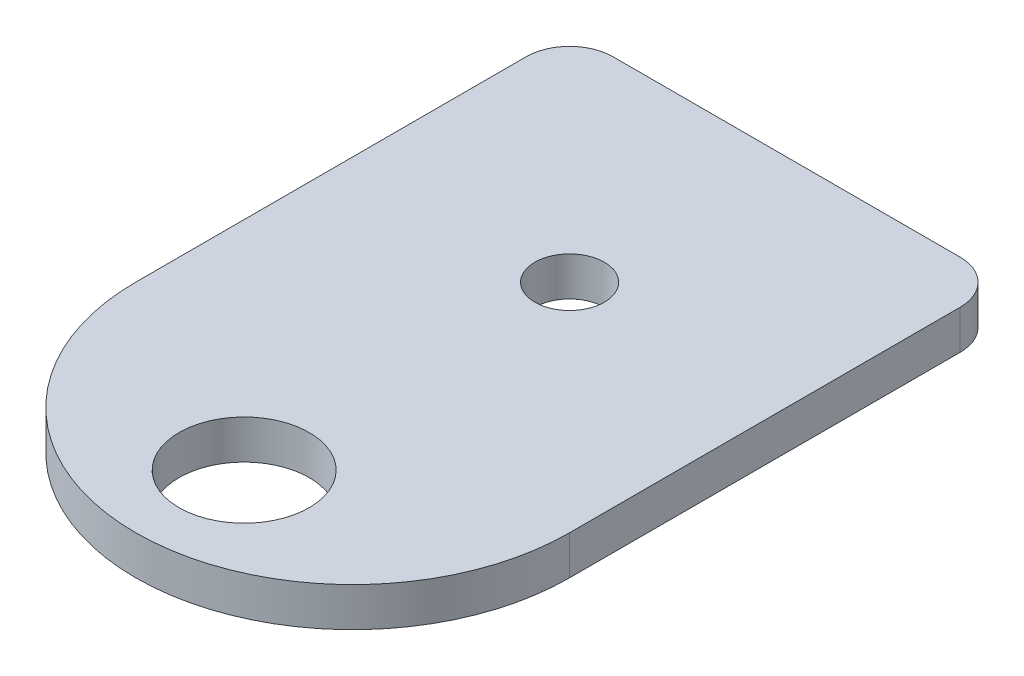
ISO-10303-21;
HEADER;
FILE_DESCRIPTION(('STEP AP214'),'2;1');
FILE_NAME('part.step','',(''),(''),'','','');
FILE_SCHEMA(('AUTOMOTIVE_DESIGN { 1 0 10303 214 1 1 1 1 }'));
ENDSEC;
DATA;
#1=APPLICATION_CONTEXT('core data for automotive mechanical design processes');
#2=APPLICATION_PROTOCOL_DEFINITION('international standard','automotive_design',2000,#1);
#3=PRODUCT_CONTEXT('',#1,'mechanical');
#4=PRODUCT('Part','Part','',(#3));
#5=PRODUCT_RELATED_PRODUCT_CATEGORY('part','',(#4));
#6=PRODUCT_DEFINITION_FORMATION('','',#4);
#7=PRODUCT_DEFINITION_CONTEXT('part definition',#1,'design');
#8=PRODUCT_DEFINITION('design','',#6,#7);
#9=PRODUCT_DEFINITION_SHAPE('','',#8);
#10=(LENGTH_UNIT() NAMED_UNIT(*) SI_UNIT(.MILLI.,.METRE.));
#11=(NAMED_UNIT(*) PLANE_ANGLE_UNIT() SI_UNIT($,.RADIAN.));
#12=(NAMED_UNIT(*) SI_UNIT($,.STERADIAN.) SOLID_ANGLE_UNIT());
#13=UNCERTAINTY_MEASURE_WITH_UNIT(LENGTH_MEASURE(1.E-05),#10,'distance_accuracy_value','');
#14=(GEOMETRIC_REPRESENTATION_CONTEXT(3) GLOBAL_UNCERTAINTY_ASSIGNED_CONTEXT((#13)) GLOBAL_UNIT_ASSIGNED_CONTEXT((#10,
#11,#12)) REPRESENTATION_CONTEXT('',''));
#15=CARTESIAN_POINT('',(0.,0.,0.));
#16=DIRECTION('',(0.,0.,1.));
#17=DIRECTION('',(1.,0.,0.));
#18=AXIS2_PLACEMENT_3D('',#15,#16,#17);
#19=CARTESIAN_POINT('',(22.86,2.286,2.54));
#20=DIRECTION('',(0.,-1.,0.));
#21=DIRECTION('',(0.,0.,-1.));
#22=AXIS2_PLACEMENT_3D('',#19,#20,#21);
#23=CYLINDRICAL_SURFACE('',#22,2.54);
#24=DIRECTION('',(0.,-1.,0.));
#25=VECTOR('',#24,1.);
#26=CARTESIAN_POINT('',(22.86,2.286,0.));
#27=LINE('',#26,#25);
#28=CARTESIAN_POINT('',(22.86,2.286,0.));
#29=VERTEX_POINT('',#28);
#30=CARTESIAN_POINT('',(22.86,0.,0.));
#31=VERTEX_POINT('',#30);
#32=EDGE_CURVE('E121',#29,#31,#27,.T.);
#33=ORIENTED_EDGE('',*,*,#32,.F.);
#34=CARTESIAN_POINT('',(22.86,2.286,2.54));
#35=DIRECTION('',(0.,1.,0.));
#36=DIRECTION('',(0.,0.,1.));
#37=AXIS2_PLACEMENT_3D('',#34,#35,#36);
#38=CIRCLE('',#37,2.54);
#39=CARTESIAN_POINT('',(25.4,2.286,2.54));
#40=VERTEX_POINT('',#39);
#41=EDGE_CURVE('E40',#40,#29,#38,.T.);
#42=ORIENTED_EDGE('',*,*,#41,.F.);
#43=DIRECTION('',(0.,-1.,0.));
#44=VECTOR('',#43,1.);
#45=CARTESIAN_POINT('',(25.4,2.286,2.54));
#46=LINE('',#45,#44);
#47=CARTESIAN_POINT('',(25.4,0.,2.54));
#48=VERTEX_POINT('',#47);
#49=EDGE_CURVE('E89',#48,#40,#46,.F.);
#50=ORIENTED_EDGE('',*,*,#49,.F.);
#51=CARTESIAN_POINT('',(22.86,0.,2.54));
#52=DIRECTION('',(0.,1.,0.));
#53=DIRECTION('',(0.,0.,1.));
#54=AXIS2_PLACEMENT_3D('',#51,#52,#53);
#55=CIRCLE('',#54,2.54);
#56=EDGE_CURVE('E11',#31,#48,#55,.F.);
#57=ORIENTED_EDGE('',*,*,#56,.F.);
#58=EDGE_LOOP('',(#33,#42,#50,#57));
#59=FACE_BOUND('',#58,.T.);
#60=ADVANCED_FACE('F33',(#59),#23,.T.);
#61=CARTESIAN_POINT('',(2.54,2.286,2.54));
#62=DIRECTION('',(0.,1.,0.));
#63=DIRECTION('',(0.,0.,1.));
#64=AXIS2_PLACEMENT_3D('',#61,#62,#63);
#65=CYLINDRICAL_SURFACE('',#64,2.54);
#66=DIRECTION('',(0.,-1.,0.));
#67=VECTOR('',#66,1.);
#68=CARTESIAN_POINT('',(0.,2.286,2.54));
#69=LINE('',#68,#67);
#70=CARTESIAN_POINT('',(0.,2.286,2.54));
#71=VERTEX_POINT('',#70);
#72=CARTESIAN_POINT('',(0.,0.,2.54));
#73=VERTEX_POINT('',#72);
#74=EDGE_CURVE('E106',#71,#73,#69,.T.);
#75=ORIENTED_EDGE('',*,*,#74,.F.);
#76=CARTESIAN_POINT('',(2.54,2.286,2.54));
#77=DIRECTION('',(0.,1.,0.));
#78=DIRECTION('',(0.,0.,1.));
#79=AXIS2_PLACEMENT_3D('',#76,#77,#78);
#80=CIRCLE('',#79,2.54);
#81=CARTESIAN_POINT('',(2.54,2.286,0.));
#82=VERTEX_POINT('',#81);
#83=EDGE_CURVE('E117',#82,#71,#80,.T.);
#84=ORIENTED_EDGE('',*,*,#83,.F.);
#85=DIRECTION('',(0.,-1.,0.));
#86=VECTOR('',#85,1.);
#87=CARTESIAN_POINT('',(2.54,2.286,0.));
#88=LINE('',#87,#86);
#89=CARTESIAN_POINT('',(2.54,0.,0.));
#90=VERTEX_POINT('',#89);
#91=EDGE_CURVE('E110',#90,#82,#88,.F.);
#92=ORIENTED_EDGE('',*,*,#91,.F.);
#93=CARTESIAN_POINT('',(2.54,0.,2.54));
#94=DIRECTION('',(0.,1.,0.));
#95=DIRECTION('',(0.,0.,1.));
#96=AXIS2_PLACEMENT_3D('',#93,#94,#95);
#97=CIRCLE('',#96,2.54);
#98=EDGE_CURVE('E119',#73,#90,#97,.F.);
#99=ORIENTED_EDGE('',*,*,#98,.F.);
#100=EDGE_LOOP('',(#75,#84,#92,#99));
#101=FACE_BOUND('',#100,.T.);
#102=ADVANCED_FACE('F160',(#101),#65,.T.);
#103=CARTESIAN_POINT('',(12.7,2.286,25.4));
#104=DIRECTION('',(0.,-1.,0.));
#105=DIRECTION('',(0.,0.,-1.));
#106=AXIS2_PLACEMENT_3D('',#103,#104,#105);
#107=CYLINDRICAL_SURFACE('',#106,12.7);
#108=CARTESIAN_POINT('',(12.7,0.,25.4));
#109=DIRECTION('',(0.,1.,0.));
#110=DIRECTION('',(0.,0.,1.));
#111=AXIS2_PLACEMENT_3D('',#108,#109,#110);
#112=CIRCLE('',#111,12.7);
#113=CARTESIAN_POINT('',(0.,0.,25.4));
#114=VERTEX_POINT('',#113);
#115=CARTESIAN_POINT('',(25.4,0.,25.4));
#116=VERTEX_POINT('',#115);
#117=EDGE_CURVE('E105',#114,#116,#112,.T.);
#118=ORIENTED_EDGE('',*,*,#117,.T.);
#119=DIRECTION('',(0.,-1.,0.));
#120=VECTOR('',#119,1.);
#121=CARTESIAN_POINT('',(25.4,2.286,25.4));
#122=LINE('',#121,#120);
#123=CARTESIAN_POINT('',(25.4,2.286,25.4));
#124=VERTEX_POINT('',#123);
#125=EDGE_CURVE('E87',#124,#116,#122,.T.);
#126=ORIENTED_EDGE('',*,*,#125,.F.);
#127=CARTESIAN_POINT('',(12.7,2.286,25.4));
#128=DIRECTION('',(0.,1.,0.));
#129=DIRECTION('',(0.,0.,1.));
#130=AXIS2_PLACEMENT_3D('',#127,#128,#129);
#131=CIRCLE('',#130,12.7);
#132=CARTESIAN_POINT('',(0.,2.286,25.4));
#133=VERTEX_POINT('',#132);
#134=EDGE_CURVE('E92',#133,#124,#131,.T.);
#135=ORIENTED_EDGE('',*,*,#134,.F.);
#136=DIRECTION('',(0.,-1.,0.));
#137=VECTOR('',#136,1.);
#138=CARTESIAN_POINT('',(0.,2.286,25.4));
#139=LINE('',#138,#137);
#140=EDGE_CURVE('E107',#133,#114,#139,.T.);
#141=ORIENTED_EDGE('',*,*,#140,.T.);
#142=EDGE_LOOP('',(#118,#126,#135,#141));
#143=FACE_BOUND('',#142,.T.);
#144=ADVANCED_FACE('F103',(#143),#107,.T.);
#145=CARTESIAN_POINT('',(25.4,2.286,0.));
#146=DIRECTION('',(1.,0.,0.));
#147=DIRECTION('',(0.,0.,-1.));
#148=AXIS2_PLACEMENT_3D('',#145,#146,#147);
#149=PLANE('',#148);
#150=DIRECTION('',(0.,0.,1.));
#151=VECTOR('',#150,1.);
#152=CARTESIAN_POINT('',(25.4,0.,0.));
#153=LINE('',#152,#151);
#154=EDGE_CURVE('E134',#48,#116,#153,.T.);
#155=ORIENTED_EDGE('',*,*,#154,.F.);
#156=ORIENTED_EDGE('',*,*,#49,.T.);
#157=DIRECTION('',(0.,0.,1.));
#158=VECTOR('',#157,1.);
#159=CARTESIAN_POINT('',(25.4,2.286,0.));
#160=LINE('',#159,#158);
#161=EDGE_CURVE('E82',#40,#124,#160,.T.);
#162=ORIENTED_EDGE('',*,*,#161,.T.);
#163=ORIENTED_EDGE('',*,*,#125,.T.);
#164=EDGE_LOOP('',(#155,#156,#162,#163));
#165=FACE_BOUND('',#164,.T.);
#166=ADVANCED_FACE('F85',(#165),#149,.T.);
#167=CARTESIAN_POINT('',(0.,2.286,0.));
#168=DIRECTION('',(0.,0.,-1.));
#169=DIRECTION('',(-1.,0.,0.));
#170=AXIS2_PLACEMENT_3D('',#167,#168,#169);
#171=PLANE('',#170);
#172=DIRECTION('',(1.,0.,0.));
#173=VECTOR('',#172,1.);
#174=CARTESIAN_POINT('',(0.,2.286,0.));
#175=LINE('',#174,#173);
#176=EDGE_CURVE('E91',#82,#29,#175,.T.);
#177=ORIENTED_EDGE('',*,*,#176,.T.);
#178=ORIENTED_EDGE('',*,*,#32,.T.);
#179=DIRECTION('',(1.,0.,0.));
#180=VECTOR('',#179,1.);
#181=CARTESIAN_POINT('',(0.,0.,0.));
#182=LINE('',#181,#180);
#183=EDGE_CURVE('E137',#90,#31,#182,.T.);
#184=ORIENTED_EDGE('',*,*,#183,.F.);
#185=ORIENTED_EDGE('',*,*,#91,.T.);
#186=EDGE_LOOP('',(#177,#178,#184,#185));
#187=FACE_BOUND('',#186,.T.);
#188=ADVANCED_FACE('F128',(#187),#171,.T.);
#189=CARTESIAN_POINT('',(0.,2.286,0.));
#190=DIRECTION('',(1.,0.,0.));
#191=DIRECTION('',(0.,0.,-1.));
#192=AXIS2_PLACEMENT_3D('',#189,#190,#191);
#193=PLANE('',#192);
#194=DIRECTION('',(0.,0.,1.));
#195=VECTOR('',#194,1.);
#196=CARTESIAN_POINT('',(0.,2.286,0.));
#197=LINE('',#196,#195);
#198=EDGE_CURVE('E97',#71,#133,#197,.T.);
#199=ORIENTED_EDGE('',*,*,#198,.F.);
#200=ORIENTED_EDGE('',*,*,#74,.T.);
#201=DIRECTION('',(0.,0.,1.));
#202=VECTOR('',#201,1.);
#203=CARTESIAN_POINT('',(0.,0.,0.));
#204=LINE('',#203,#202);
#205=EDGE_CURVE('E101',#73,#114,#204,.T.);
#206=ORIENTED_EDGE('',*,*,#205,.T.);
#207=ORIENTED_EDGE('',*,*,#140,.F.);
#208=EDGE_LOOP('',(#199,#200,#206,#207));
#209=FACE_BOUND('',#208,.T.);
#210=ADVANCED_FACE('F140',(#209),#193,.F.);
#211=CARTESIAN_POINT('',(0.,2.286,0.));
#212=DIRECTION('',(0.,1.,0.));
#213=DIRECTION('',(0.,0.,1.));
#214=AXIS2_PLACEMENT_3D('',#211,#212,#213);
#215=PLANE('',#214);
#216=CARTESIAN_POINT('',(12.7,2.286,12.7));
#217=DIRECTION('',(0.,1.,0.));
#218=DIRECTION('',(0.,0.,1.));
#219=AXIS2_PLACEMENT_3D('',#216,#217,#218);
#220=CIRCLE('',#219,2.032);
#221=CARTESIAN_POINT('',(12.7,2.286,14.732));
#222=VERTEX_POINT('',#221);
#223=EDGE_CURVE('E135',#222,#222,#220,.T.);
#224=ORIENTED_EDGE('',*,*,#223,.F.);
#225=EDGE_LOOP('',(#224));
#226=FACE_BOUND('',#225,.T.);
#227=CARTESIAN_POINT('',(12.7,2.286,31.75));
#228=DIRECTION('',(0.,1.,0.));
#229=DIRECTION('',(0.,0.,1.));
#230=AXIS2_PLACEMENT_3D('',#227,#228,#229);
#231=CIRCLE('',#230,3.81);
#232=CARTESIAN_POINT('',(12.7,2.286,35.56));
#233=VERTEX_POINT('',#232);
#234=EDGE_CURVE('E242',#233,#233,#231,.T.);
#235=ORIENTED_EDGE('',*,*,#234,.F.);
#236=EDGE_LOOP('',(#235));
#237=FACE_BOUND('',#236,.T.);
#238=ORIENTED_EDGE('',*,*,#161,.F.);
#239=ORIENTED_EDGE('',*,*,#41,.T.);
#240=ORIENTED_EDGE('',*,*,#176,.F.);
#241=ORIENTED_EDGE('',*,*,#83,.T.);
#242=ORIENTED_EDGE('',*,*,#198,.T.);
#243=ORIENTED_EDGE('',*,*,#134,.T.);
#244=EDGE_LOOP('',(#238,#239,#240,#241,#242,#243));
#245=FACE_BOUND('',#244,.T.);
#246=ADVANCED_FACE('F95',(#226,#237,#245),#215,.T.);
#247=CARTESIAN_POINT('',(0.,0.,0.));
#248=DIRECTION('',(0.,1.,0.));
#249=DIRECTION('',(0.,0.,1.));
#250=AXIS2_PLACEMENT_3D('',#247,#248,#249);
#251=PLANE('',#250);
#252=CARTESIAN_POINT('',(12.7,0.,12.7));
#253=DIRECTION('',(0.,1.,0.));
#254=DIRECTION('',(0.,0.,1.));
#255=AXIS2_PLACEMENT_3D('',#252,#253,#254);
#256=CIRCLE('',#255,2.032);
#257=CARTESIAN_POINT('',(12.7,0.,14.732));
#258=VERTEX_POINT('',#257);
#259=EDGE_CURVE('E241',#258,#258,#256,.T.);
#260=ORIENTED_EDGE('',*,*,#259,.T.);
#261=EDGE_LOOP('',(#260));
#262=FACE_BOUND('',#261,.T.);
#263=CARTESIAN_POINT('',(12.7,0.,31.75));
#264=DIRECTION('',(0.,1.,0.));
#265=DIRECTION('',(0.,0.,1.));
#266=AXIS2_PLACEMENT_3D('',#263,#264,#265);
#267=CIRCLE('',#266,3.81);
#268=CARTESIAN_POINT('',(12.7,0.,35.56));
#269=VERTEX_POINT('',#268);
#270=EDGE_CURVE('E243',#269,#269,#267,.T.);
#271=ORIENTED_EDGE('',*,*,#270,.T.);
#272=EDGE_LOOP('',(#271));
#273=FACE_BOUND('',#272,.T.);
#274=ORIENTED_EDGE('',*,*,#183,.T.);
#275=ORIENTED_EDGE('',*,*,#56,.T.);
#276=ORIENTED_EDGE('',*,*,#154,.T.);
#277=ORIENTED_EDGE('',*,*,#117,.F.);
#278=ORIENTED_EDGE('',*,*,#205,.F.);
#279=ORIENTED_EDGE('',*,*,#98,.T.);
#280=EDGE_LOOP('',(#274,#275,#276,#277,#278,#279));
#281=FACE_BOUND('',#280,.T.);
#282=ADVANCED_FACE('F142',(#262,#273,#281),#251,.F.);
#283=CARTESIAN_POINT('',(12.7,0.,31.75));
#284=DIRECTION('',(0.,1.,0.));
#285=DIRECTION('',(0.,0.,1.));
#286=AXIS2_PLACEMENT_3D('',#283,#284,#285);
#287=CYLINDRICAL_SURFACE('',#286,3.81);
#288=ORIENTED_EDGE('',*,*,#234,.T.);
#289=EDGE_LOOP('',(#288));
#290=FACE_BOUND('',#289,.T.);
#291=ORIENTED_EDGE('',*,*,#270,.F.);
#292=EDGE_LOOP('',(#291));
#293=FACE_BOUND('',#292,.T.);
#294=ADVANCED_FACE('F144',(#290,#293),#287,.F.);
#295=CARTESIAN_POINT('',(12.7,0.,12.7));
#296=DIRECTION('',(0.,1.,0.));
#297=DIRECTION('',(0.,0.,1.));
#298=AXIS2_PLACEMENT_3D('',#295,#296,#297);
#299=CYLINDRICAL_SURFACE('',#298,2.032);
#300=ORIENTED_EDGE('',*,*,#223,.T.);
#301=EDGE_LOOP('',(#300));
#302=FACE_BOUND('',#301,.T.);
#303=ORIENTED_EDGE('',*,*,#259,.F.);
#304=EDGE_LOOP('',(#303));
#305=FACE_BOUND('',#304,.T.);
#306=ADVANCED_FACE('F151',(#302,#305),#299,.F.);
#307=CLOSED_SHELL('',(#60,#102,#144,#166,#188,#210,#246,#282,#294,#306));
#308=MANIFOLD_SOLID_BREP('B2',#307);
#309=ADVANCED_BREP_SHAPE_REPRESENTATION('',(#18,#308),#14);
#310=SHAPE_DEFINITION_REPRESENTATION(#9,#309);
ENDSEC;
END-ISO-10303-21;
